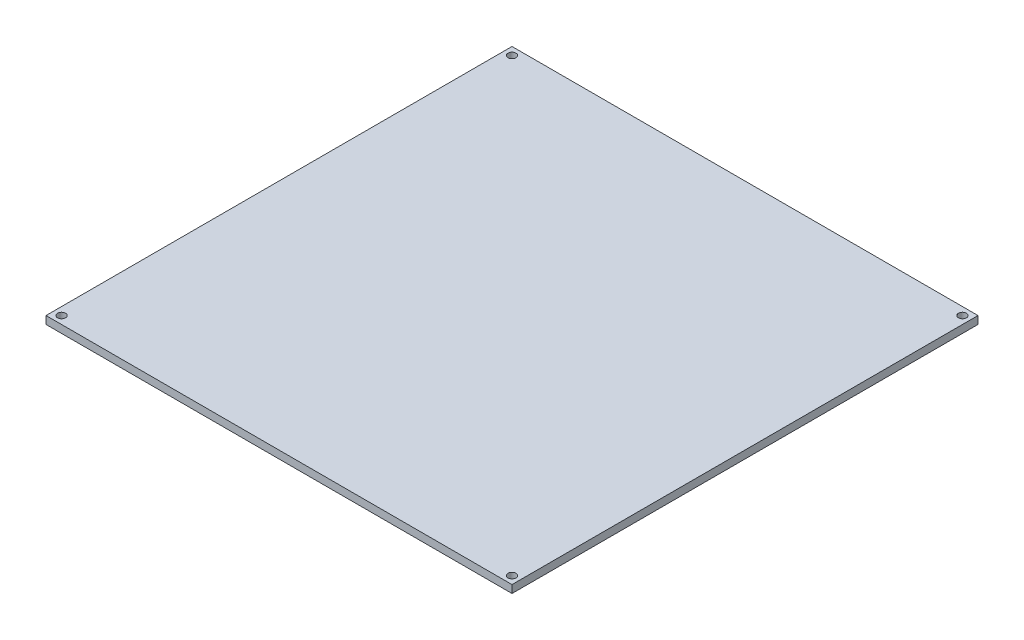
ISO-10303-21;
HEADER;
FILE_DESCRIPTION(('STEP AP214'),'2;1');
FILE_NAME('part.step','',(''),(''),'','','');
FILE_SCHEMA(('AUTOMOTIVE_DESIGN { 1 0 10303 214 1 1 1 1 }'));
ENDSEC;
DATA;
#1=APPLICATION_CONTEXT('core data for automotive mechanical design processes');
#2=APPLICATION_PROTOCOL_DEFINITION('international standard','automotive_design',2000,#1);
#3=PRODUCT_CONTEXT('',#1,'mechanical');
#4=PRODUCT('Part','Part','',(#3));
#5=PRODUCT_RELATED_PRODUCT_CATEGORY('part','',(#4));
#6=PRODUCT_DEFINITION_FORMATION('','',#4);
#7=PRODUCT_DEFINITION_CONTEXT('part definition',#1,'design');
#8=PRODUCT_DEFINITION('design','',#6,#7);
#9=PRODUCT_DEFINITION_SHAPE('','',#8);
#10=(LENGTH_UNIT() NAMED_UNIT(*) SI_UNIT(.MILLI.,.METRE.));
#11=(NAMED_UNIT(*) PLANE_ANGLE_UNIT() SI_UNIT($,.RADIAN.));
#12=(NAMED_UNIT(*) SI_UNIT($,.STERADIAN.) SOLID_ANGLE_UNIT());
#13=UNCERTAINTY_MEASURE_WITH_UNIT(LENGTH_MEASURE(1.E-05),#10,'distance_accuracy_value','');
#14=(GEOMETRIC_REPRESENTATION_CONTEXT(3) GLOBAL_UNCERTAINTY_ASSIGNED_CONTEXT((#13)) GLOBAL_UNIT_ASSIGNED_CONTEXT((#10,
#11,#12)) REPRESENTATION_CONTEXT('',''));
#15=CARTESIAN_POINT('',(0.,0.,0.));
#16=DIRECTION('',(0.,0.,1.));
#17=DIRECTION('',(1.,0.,0.));
#18=AXIS2_PLACEMENT_3D('',#15,#16,#17);
#19=CARTESIAN_POINT('',(0.,3.,-195.));
#20=DIRECTION('',(0.,0.,1.));
#21=DIRECTION('',(1.,0.,0.));
#22=AXIS2_PLACEMENT_3D('',#19,#20,#21);
#23=PLANE('',#22);
#24=DIRECTION('',(-1.,0.,0.));
#25=VECTOR('',#24,1.);
#26=CARTESIAN_POINT('',(0.,0.,-195.));
#27=LINE('',#26,#25);
#28=CARTESIAN_POINT('',(195.,0.,-195.));
#29=VERTEX_POINT('',#28);
#30=CARTESIAN_POINT('',(15.,0.,-195.));
#31=VERTEX_POINT('',#30);
#32=EDGE_CURVE('E124',#29,#31,#27,.T.);
#33=ORIENTED_EDGE('',*,*,#32,.T.);
#34=DIRECTION('',(0.,-1.,0.));
#35=VECTOR('',#34,1.);
#36=CARTESIAN_POINT('',(15.,3.,-195.));
#37=LINE('',#36,#35);
#38=CARTESIAN_POINT('',(15.,3.,-195.));
#39=VERTEX_POINT('',#38);
#40=EDGE_CURVE('E11',#39,#31,#37,.T.);
#41=ORIENTED_EDGE('',*,*,#40,.F.);
#42=DIRECTION('',(-1.,0.,0.));
#43=VECTOR('',#42,1.);
#44=CARTESIAN_POINT('',(0.,3.,-195.));
#45=LINE('',#44,#43);
#46=CARTESIAN_POINT('',(195.,3.,-195.));
#47=VERTEX_POINT('',#46);
#48=EDGE_CURVE('E90',#47,#39,#45,.T.);
#49=ORIENTED_EDGE('',*,*,#48,.F.);
#50=DIRECTION('',(0.,-1.,0.));
#51=VECTOR('',#50,1.);
#52=CARTESIAN_POINT('',(195.,3.,-195.));
#53=LINE('',#52,#51);
#54=EDGE_CURVE('E57',#47,#29,#53,.T.);
#55=ORIENTED_EDGE('',*,*,#54,.T.);
#56=EDGE_LOOP('',(#33,#41,#49,#55));
#57=FACE_BOUND('',#56,.T.);
#58=ADVANCED_FACE('F39',(#57),#23,.F.);
#59=CARTESIAN_POINT('',(15.,3.,0.));
#60=DIRECTION('',(1.,0.,0.));
#61=DIRECTION('',(0.,0.,-1.));
#62=AXIS2_PLACEMENT_3D('',#59,#60,#61);
#63=PLANE('',#62);
#64=DIRECTION('',(0.,0.,1.));
#65=VECTOR('',#64,1.);
#66=CARTESIAN_POINT('',(15.,0.,0.));
#67=LINE('',#66,#65);
#68=CARTESIAN_POINT('',(15.,0.,-15.));
#69=VERTEX_POINT('',#68);
#70=EDGE_CURVE('E96',#31,#69,#67,.T.);
#71=ORIENTED_EDGE('',*,*,#70,.T.);
#72=DIRECTION('',(0.,-1.,0.));
#73=VECTOR('',#72,1.);
#74=CARTESIAN_POINT('',(15.,3.,-15.));
#75=LINE('',#74,#73);
#76=CARTESIAN_POINT('',(15.,3.,-15.));
#77=VERTEX_POINT('',#76);
#78=EDGE_CURVE('E49',#77,#69,#75,.T.);
#79=ORIENTED_EDGE('',*,*,#78,.F.);
#80=DIRECTION('',(0.,0.,1.));
#81=VECTOR('',#80,1.);
#82=CARTESIAN_POINT('',(15.,3.,0.));
#83=LINE('',#82,#81);
#84=EDGE_CURVE('E82',#39,#77,#83,.T.);
#85=ORIENTED_EDGE('',*,*,#84,.F.);
#86=ORIENTED_EDGE('',*,*,#40,.T.);
#87=EDGE_LOOP('',(#71,#79,#85,#86));
#88=FACE_BOUND('',#87,.T.);
#89=ADVANCED_FACE('F95',(#88),#63,.F.);
#90=CARTESIAN_POINT('',(0.,3.,-15.));
#91=DIRECTION('',(0.,0.,1.));
#92=DIRECTION('',(1.,0.,0.));
#93=AXIS2_PLACEMENT_3D('',#90,#91,#92);
#94=PLANE('',#93);
#95=DIRECTION('',(-1.,0.,0.));
#96=VECTOR('',#95,1.);
#97=CARTESIAN_POINT('',(0.,0.,-15.));
#98=LINE('',#97,#96);
#99=CARTESIAN_POINT('',(195.,0.,-15.));
#100=VERTEX_POINT('',#99);
#101=EDGE_CURVE('E129',#100,#69,#98,.T.);
#102=ORIENTED_EDGE('',*,*,#101,.F.);
#103=DIRECTION('',(0.,-1.,0.));
#104=VECTOR('',#103,1.);
#105=CARTESIAN_POINT('',(195.,3.,-15.));
#106=LINE('',#105,#104);
#107=CARTESIAN_POINT('',(195.,3.,-15.));
#108=VERTEX_POINT('',#107);
#109=EDGE_CURVE('E71',#108,#100,#106,.T.);
#110=ORIENTED_EDGE('',*,*,#109,.F.);
#111=DIRECTION('',(-1.,0.,0.));
#112=VECTOR('',#111,1.);
#113=CARTESIAN_POINT('',(0.,3.,-15.));
#114=LINE('',#113,#112);
#115=EDGE_CURVE('E89',#108,#77,#114,.T.);
#116=ORIENTED_EDGE('',*,*,#115,.T.);
#117=ORIENTED_EDGE('',*,*,#78,.T.);
#118=EDGE_LOOP('',(#102,#110,#116,#117));
#119=FACE_BOUND('',#118,.T.);
#120=ADVANCED_FACE('F100',(#119),#94,.T.);
#121=CARTESIAN_POINT('',(18.,3.,-192.));
#122=DIRECTION('',(0.,-1.,0.));
#123=DIRECTION('',(0.,0.,-1.));
#124=AXIS2_PLACEMENT_3D('',#121,#122,#123);
#125=CYLINDRICAL_SURFACE('',#124,1.55);
#126=CARTESIAN_POINT('',(18.,3.,-192.));
#127=DIRECTION('',(0.,1.,0.));
#128=DIRECTION('',(0.,0.,1.));
#129=AXIS2_PLACEMENT_3D('',#126,#127,#128);
#130=CIRCLE('',#129,1.55);
#131=CARTESIAN_POINT('',(18.,3.,-190.45));
#132=VERTEX_POINT('',#131);
#133=EDGE_CURVE('E155',#132,#132,#130,.T.);
#134=ORIENTED_EDGE('',*,*,#133,.T.);
#135=EDGE_LOOP('',(#134));
#136=FACE_BOUND('',#135,.T.);
#137=CARTESIAN_POINT('',(18.,0.,-192.));
#138=DIRECTION('',(0.,1.,0.));
#139=DIRECTION('',(0.,0.,1.));
#140=AXIS2_PLACEMENT_3D('',#137,#138,#139);
#141=CIRCLE('',#140,1.55);
#142=CARTESIAN_POINT('',(18.,0.,-190.45));
#143=VERTEX_POINT('',#142);
#144=EDGE_CURVE('E120',#143,#143,#141,.T.);
#145=ORIENTED_EDGE('',*,*,#144,.F.);
#146=EDGE_LOOP('',(#145));
#147=FACE_BOUND('',#146,.T.);
#148=ADVANCED_FACE('F161',(#136,#147),#125,.F.);
#149=CARTESIAN_POINT('',(192.,3.,-192.));
#150=DIRECTION('',(0.,-1.,0.));
#151=DIRECTION('',(0.,0.,-1.));
#152=AXIS2_PLACEMENT_3D('',#149,#150,#151);
#153=CYLINDRICAL_SURFACE('',#152,1.54999999999999);
#154=CARTESIAN_POINT('',(192.,3.,-192.));
#155=DIRECTION('',(0.,1.,0.));
#156=DIRECTION('',(0.,0.,1.));
#157=AXIS2_PLACEMENT_3D('',#154,#155,#156);
#158=CIRCLE('',#157,1.54999999999999);
#159=CARTESIAN_POINT('',(192.,3.,-190.45));
#160=VERTEX_POINT('',#159);
#161=EDGE_CURVE('E149',#160,#160,#158,.T.);
#162=ORIENTED_EDGE('',*,*,#161,.T.);
#163=EDGE_LOOP('',(#162));
#164=FACE_BOUND('',#163,.T.);
#165=CARTESIAN_POINT('',(192.,0.,-192.));
#166=DIRECTION('',(0.,1.,0.));
#167=DIRECTION('',(0.,0.,1.));
#168=AXIS2_PLACEMENT_3D('',#165,#166,#167);
#169=CIRCLE('',#168,1.54999999999999);
#170=CARTESIAN_POINT('',(192.,0.,-190.45));
#171=VERTEX_POINT('',#170);
#172=EDGE_CURVE('E116',#171,#171,#169,.T.);
#173=ORIENTED_EDGE('',*,*,#172,.F.);
#174=EDGE_LOOP('',(#173));
#175=FACE_BOUND('',#174,.T.);
#176=ADVANCED_FACE('F187',(#164,#175),#153,.F.);
#177=CARTESIAN_POINT('',(192.,3.,-18.));
#178=DIRECTION('',(0.,-1.,0.));
#179=DIRECTION('',(0.,0.,-1.));
#180=AXIS2_PLACEMENT_3D('',#177,#178,#179);
#181=CYLINDRICAL_SURFACE('',#180,1.54999999999999);
#182=CARTESIAN_POINT('',(192.,3.,-18.));
#183=DIRECTION('',(0.,1.,0.));
#184=DIRECTION('',(0.,0.,1.));
#185=AXIS2_PLACEMENT_3D('',#182,#183,#184);
#186=CIRCLE('',#185,1.54999999999999);
#187=CARTESIAN_POINT('',(192.,3.,-16.45));
#188=VERTEX_POINT('',#187);
#189=EDGE_CURVE('E143',#188,#188,#186,.T.);
#190=ORIENTED_EDGE('',*,*,#189,.T.);
#191=EDGE_LOOP('',(#190));
#192=FACE_BOUND('',#191,.T.);
#193=CARTESIAN_POINT('',(192.,0.,-18.));
#194=DIRECTION('',(0.,1.,0.));
#195=DIRECTION('',(0.,0.,1.));
#196=AXIS2_PLACEMENT_3D('',#193,#194,#195);
#197=CIRCLE('',#196,1.54999999999999);
#198=CARTESIAN_POINT('',(192.,0.,-16.45));
#199=VERTEX_POINT('',#198);
#200=EDGE_CURVE('E112',#199,#199,#197,.T.);
#201=ORIENTED_EDGE('',*,*,#200,.F.);
#202=EDGE_LOOP('',(#201));
#203=FACE_BOUND('',#202,.T.);
#204=ADVANCED_FACE('F189',(#192,#203),#181,.F.);
#205=CARTESIAN_POINT('',(18.0000000000001,3.,-18.));
#206=DIRECTION('',(0.,-1.,0.));
#207=DIRECTION('',(0.,0.,-1.));
#208=AXIS2_PLACEMENT_3D('',#205,#206,#207);
#209=CYLINDRICAL_SURFACE('',#208,1.55);
#210=CARTESIAN_POINT('',(18.0000000000001,3.,-18.));
#211=DIRECTION('',(0.,1.,0.));
#212=DIRECTION('',(0.,0.,1.));
#213=AXIS2_PLACEMENT_3D('',#210,#211,#212);
#214=CIRCLE('',#213,1.55);
#215=CARTESIAN_POINT('',(18.0000000000001,3.,-16.45));
#216=VERTEX_POINT('',#215);
#217=EDGE_CURVE('E136',#216,#216,#214,.T.);
#218=ORIENTED_EDGE('',*,*,#217,.T.);
#219=EDGE_LOOP('',(#218));
#220=FACE_BOUND('',#219,.T.);
#221=CARTESIAN_POINT('',(18.0000000000001,0.,-18.));
#222=DIRECTION('',(0.,1.,0.));
#223=DIRECTION('',(0.,0.,1.));
#224=AXIS2_PLACEMENT_3D('',#221,#222,#223);
#225=CIRCLE('',#224,1.55);
#226=CARTESIAN_POINT('',(18.0000000000001,0.,-16.45));
#227=VERTEX_POINT('',#226);
#228=EDGE_CURVE('E108',#227,#227,#225,.T.);
#229=ORIENTED_EDGE('',*,*,#228,.F.);
#230=EDGE_LOOP('',(#229));
#231=FACE_BOUND('',#230,.T.);
#232=ADVANCED_FACE('F41',(#220,#231),#209,.F.);
#233=CARTESIAN_POINT('',(195.,3.,0.));
#234=DIRECTION('',(1.,0.,0.));
#235=DIRECTION('',(0.,0.,-1.));
#236=AXIS2_PLACEMENT_3D('',#233,#234,#235);
#237=PLANE('',#236);
#238=DIRECTION('',(0.,0.,1.));
#239=VECTOR('',#238,1.);
#240=CARTESIAN_POINT('',(195.,0.,0.));
#241=LINE('',#240,#239);
#242=EDGE_CURVE('E132',#29,#100,#241,.T.);
#243=ORIENTED_EDGE('',*,*,#242,.F.);
#244=ORIENTED_EDGE('',*,*,#54,.F.);
#245=DIRECTION('',(0.,0.,1.));
#246=VECTOR('',#245,1.);
#247=CARTESIAN_POINT('',(195.,3.,0.));
#248=LINE('',#247,#246);
#249=EDGE_CURVE('E102',#47,#108,#248,.T.);
#250=ORIENTED_EDGE('',*,*,#249,.T.);
#251=ORIENTED_EDGE('',*,*,#109,.T.);
#252=EDGE_LOOP('',(#243,#244,#250,#251));
#253=FACE_BOUND('',#252,.T.);
#254=ADVANCED_FACE('F166',(#253),#237,.T.);
#255=CARTESIAN_POINT('',(0.,3.,0.));
#256=DIRECTION('',(0.,1.,0.));
#257=DIRECTION('',(0.,0.,1.));
#258=AXIS2_PLACEMENT_3D('',#255,#256,#257);
#259=PLANE('',#258);
#260=ORIENTED_EDGE('',*,*,#217,.F.);
#261=EDGE_LOOP('',(#260));
#262=FACE_BOUND('',#261,.T.);
#263=ORIENTED_EDGE('',*,*,#189,.F.);
#264=EDGE_LOOP('',(#263));
#265=FACE_BOUND('',#264,.T.);
#266=ORIENTED_EDGE('',*,*,#161,.F.);
#267=EDGE_LOOP('',(#266));
#268=FACE_BOUND('',#267,.T.);
#269=ORIENTED_EDGE('',*,*,#133,.F.);
#270=EDGE_LOOP('',(#269));
#271=FACE_BOUND('',#270,.T.);
#272=ORIENTED_EDGE('',*,*,#48,.T.);
#273=ORIENTED_EDGE('',*,*,#84,.T.);
#274=ORIENTED_EDGE('',*,*,#115,.F.);
#275=ORIENTED_EDGE('',*,*,#249,.F.);
#276=EDGE_LOOP('',(#272,#273,#274,#275));
#277=FACE_BOUND('',#276,.T.);
#278=ADVANCED_FACE('F86',(#262,#265,#268,#271,#277),#259,.T.);
#279=CARTESIAN_POINT('',(0.,0.,0.));
#280=DIRECTION('',(0.,1.,0.));
#281=DIRECTION('',(0.,0.,1.));
#282=AXIS2_PLACEMENT_3D('',#279,#280,#281);
#283=PLANE('',#282);
#284=ORIENTED_EDGE('',*,*,#228,.T.);
#285=EDGE_LOOP('',(#284));
#286=FACE_BOUND('',#285,.T.);
#287=ORIENTED_EDGE('',*,*,#200,.T.);
#288=EDGE_LOOP('',(#287));
#289=FACE_BOUND('',#288,.T.);
#290=ORIENTED_EDGE('',*,*,#172,.T.);
#291=EDGE_LOOP('',(#290));
#292=FACE_BOUND('',#291,.T.);
#293=ORIENTED_EDGE('',*,*,#144,.T.);
#294=EDGE_LOOP('',(#293));
#295=FACE_BOUND('',#294,.T.);
#296=ORIENTED_EDGE('',*,*,#32,.F.);
#297=ORIENTED_EDGE('',*,*,#242,.T.);
#298=ORIENTED_EDGE('',*,*,#101,.T.);
#299=ORIENTED_EDGE('',*,*,#70,.F.);
#300=EDGE_LOOP('',(#296,#297,#298,#299));
#301=FACE_BOUND('',#300,.T.);
#302=ADVANCED_FACE('F165',(#286,#289,#292,#295,#301),#283,.F.);
#303=CLOSED_SHELL('',(#58,#89,#120,#148,#176,#204,#232,#254,#278,#302));
#304=MANIFOLD_SOLID_BREP('B2',#303);
#305=ADVANCED_BREP_SHAPE_REPRESENTATION('',(#18,#304),#14);
#306=SHAPE_DEFINITION_REPRESENTATION(#9,#305);
ENDSEC;
END-ISO-10303-21;
